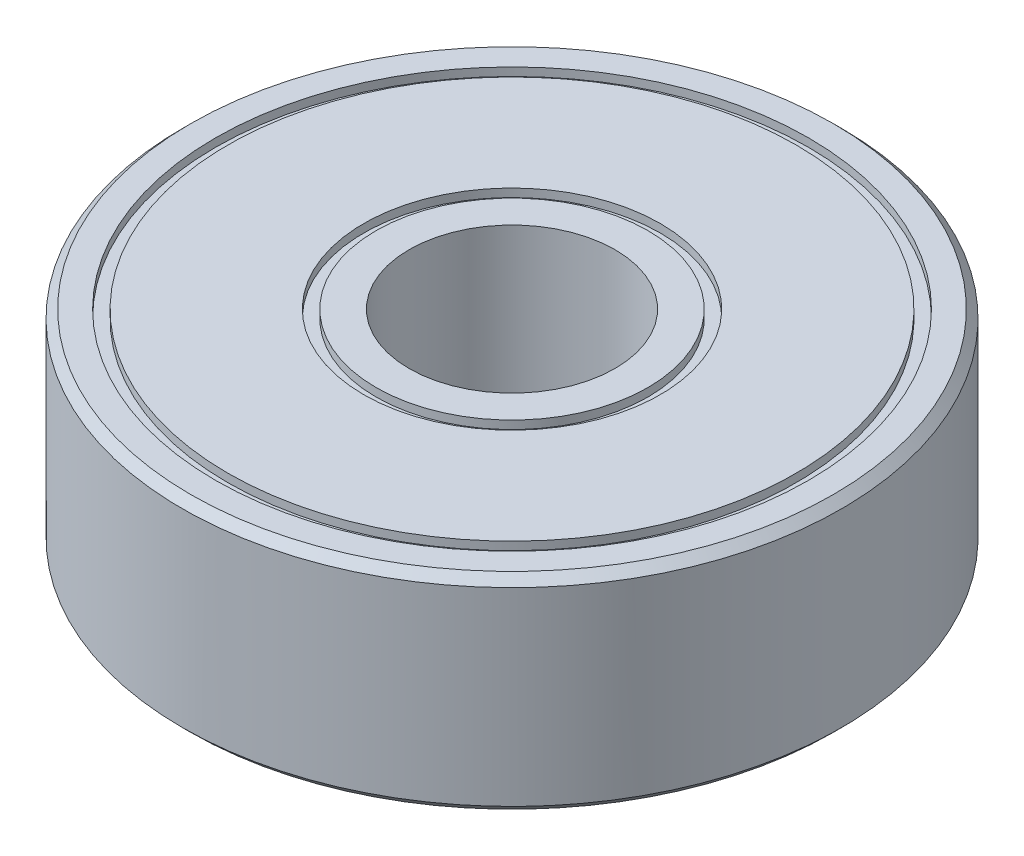
ISO-10303-21;
HEADER;
FILE_DESCRIPTION(('STEP AP214'),'2;1');
FILE_NAME('part.step','',(''),(''),'','','');
FILE_SCHEMA(('AUTOMOTIVE_DESIGN { 1 0 10303 214 1 1 1 1 }'));
ENDSEC;
DATA;
#1=APPLICATION_CONTEXT('core data for automotive mechanical design processes');
#2=APPLICATION_PROTOCOL_DEFINITION('international standard','automotive_design',2000,#1);
#3=PRODUCT_CONTEXT('',#1,'mechanical');
#4=PRODUCT('Part','Part','',(#3));
#5=PRODUCT_RELATED_PRODUCT_CATEGORY('part','',(#4));
#6=PRODUCT_DEFINITION_FORMATION('','',#4);
#7=PRODUCT_DEFINITION_CONTEXT('part definition',#1,'design');
#8=PRODUCT_DEFINITION('design','',#6,#7);
#9=PRODUCT_DEFINITION_SHAPE('','',#8);
#10=(LENGTH_UNIT() NAMED_UNIT(*) SI_UNIT(.MILLI.,.METRE.));
#11=(NAMED_UNIT(*) PLANE_ANGLE_UNIT() SI_UNIT($,.RADIAN.));
#12=(NAMED_UNIT(*) SI_UNIT($,.STERADIAN.) SOLID_ANGLE_UNIT());
#13=UNCERTAINTY_MEASURE_WITH_UNIT(LENGTH_MEASURE(1.E-05),#10,'distance_accuracy_value','');
#14=(GEOMETRIC_REPRESENTATION_CONTEXT(3) GLOBAL_UNCERTAINTY_ASSIGNED_CONTEXT((#13)) GLOBAL_UNIT_ASSIGNED_CONTEXT((#10,
#11,#12)) REPRESENTATION_CONTEXT('',''));
#15=CARTESIAN_POINT('',(0.,0.,0.));
#16=DIRECTION('',(0.,0.,1.));
#17=DIRECTION('',(1.,0.,0.));
#18=AXIS2_PLACEMENT_3D('',#15,#16,#17);
#19=CARTESIAN_POINT('',(0.,5.,0.));
#20=DIRECTION('',(0.,-1.,0.));
#21=DIRECTION('',(0.,0.,-1.));
#22=AXIS2_PLACEMENT_3D('',#19,#20,#21);
#23=CYLINDRICAL_SURFACE('',#22,2.5);
#24=CARTESIAN_POINT('',(0.,5.,0.));
#25=DIRECTION('',(0.,-1.,0.));
#26=DIRECTION('',(0.,0.,-1.));
#27=AXIS2_PLACEMENT_3D('',#24,#25,#26);
#28=CIRCLE('',#27,2.5);
#29=CARTESIAN_POINT('',(0.,5.,-2.5));
#30=VERTEX_POINT('',#29);
#31=EDGE_CURVE('E18',#30,#30,#28,.T.);
#32=ORIENTED_EDGE('',*,*,#31,.F.);
#33=EDGE_LOOP('',(#32));
#34=FACE_BOUND('',#33,.T.);
#35=CARTESIAN_POINT('',(0.,0.,0.));
#36=DIRECTION('',(0.,-1.,0.));
#37=DIRECTION('',(0.,0.,-1.));
#38=AXIS2_PLACEMENT_3D('',#35,#36,#37);
#39=CIRCLE('',#38,2.5);
#40=CARTESIAN_POINT('',(0.,0.,-2.5));
#41=VERTEX_POINT('',#40);
#42=EDGE_CURVE('E82',#41,#41,#39,.T.);
#43=ORIENTED_EDGE('',*,*,#42,.T.);
#44=EDGE_LOOP('',(#43));
#45=FACE_BOUND('',#44,.T.);
#46=ADVANCED_FACE('F15',(#34,#45),#23,.F.);
#47=CARTESIAN_POINT('',(0.,5.,0.));
#48=DIRECTION('',(0.,1.,0.));
#49=DIRECTION('',(0.,0.,1.));
#50=AXIS2_PLACEMENT_3D('',#47,#48,#49);
#51=PLANE('',#50);
#52=ORIENTED_EDGE('',*,*,#31,.T.);
#53=EDGE_LOOP('',(#52));
#54=FACE_BOUND('',#53,.T.);
#55=CARTESIAN_POINT('',(0.,5.,0.));
#56=DIRECTION('',(0.,1.,0.));
#57=DIRECTION('',(0.,0.,1.));
#58=AXIS2_PLACEMENT_3D('',#55,#56,#57);
#59=CIRCLE('',#58,3.3);
#60=CARTESIAN_POINT('',(0.,5.,3.3));
#61=VERTEX_POINT('',#60);
#62=EDGE_CURVE('E80',#61,#61,#59,.F.);
#63=ORIENTED_EDGE('',*,*,#62,.F.);
#64=EDGE_LOOP('',(#63));
#65=FACE_BOUND('',#64,.T.);
#66=ADVANCED_FACE('F89',(#54,#65),#51,.T.);
#67=CARTESIAN_POINT('',(0.,0.,0.));
#68=DIRECTION('',(0.,1.,0.));
#69=DIRECTION('',(0.,0.,1.));
#70=AXIS2_PLACEMENT_3D('',#67,#68,#69);
#71=PLANE('',#70);
#72=ORIENTED_EDGE('',*,*,#42,.F.);
#73=EDGE_LOOP('',(#72));
#74=FACE_BOUND('',#73,.T.);
#75=CARTESIAN_POINT('',(0.,0.,0.));
#76=DIRECTION('',(0.,1.,0.));
#77=DIRECTION('',(0.,0.,1.));
#78=AXIS2_PLACEMENT_3D('',#75,#76,#77);
#79=CIRCLE('',#78,3.3);
#80=CARTESIAN_POINT('',(0.,0.,3.3));
#81=VERTEX_POINT('',#80);
#82=EDGE_CURVE('E77',#81,#81,#79,.T.);
#83=ORIENTED_EDGE('',*,*,#82,.F.);
#84=EDGE_LOOP('',(#83));
#85=FACE_BOUND('',#84,.T.);
#86=ADVANCED_FACE('F97',(#74,#85),#71,.F.);
#87=CARTESIAN_POINT('',(0.,5.,0.));
#88=DIRECTION('',(0.,1.,0.));
#89=DIRECTION('',(0.,0.,1.));
#90=AXIS2_PLACEMENT_3D('',#87,#88,#89);
#91=CYLINDRICAL_SURFACE('',#90,3.3);
#92=ORIENTED_EDGE('',*,*,#62,.T.);
#93=EDGE_LOOP('',(#92));
#94=FACE_BOUND('',#93,.T.);
#95=CARTESIAN_POINT('',(0.,4.8,0.));
#96=DIRECTION('',(0.,1.,0.));
#97=DIRECTION('',(0.,0.,1.));
#98=AXIS2_PLACEMENT_3D('',#95,#96,#97);
#99=CIRCLE('',#98,3.3);
#100=CARTESIAN_POINT('',(0.,4.8,3.3));
#101=VERTEX_POINT('',#100);
#102=EDGE_CURVE('E74',#101,#101,#99,.F.);
#103=ORIENTED_EDGE('',*,*,#102,.F.);
#104=EDGE_LOOP('',(#103));
#105=FACE_BOUND('',#104,.T.);
#106=ADVANCED_FACE('F172',(#94,#105),#91,.T.);
#107=CARTESIAN_POINT('',(0.,5.,0.));
#108=DIRECTION('',(0.,1.,0.));
#109=DIRECTION('',(0.,0.,1.));
#110=AXIS2_PLACEMENT_3D('',#107,#108,#109);
#111=CYLINDRICAL_SURFACE('',#110,3.3);
#112=ORIENTED_EDGE('',*,*,#82,.T.);
#113=EDGE_LOOP('',(#112));
#114=FACE_BOUND('',#113,.T.);
#115=CARTESIAN_POINT('',(0.,0.2,0.));
#116=DIRECTION('',(0.,1.,0.));
#117=DIRECTION('',(0.,0.,1.));
#118=AXIS2_PLACEMENT_3D('',#115,#116,#117);
#119=CIRCLE('',#118,3.3);
#120=CARTESIAN_POINT('',(0.,0.2,3.3));
#121=VERTEX_POINT('',#120);
#122=EDGE_CURVE('E71',#121,#121,#119,.T.);
#123=ORIENTED_EDGE('',*,*,#122,.F.);
#124=EDGE_LOOP('',(#123));
#125=FACE_BOUND('',#124,.T.);
#126=ADVANCED_FACE('F168',(#114,#125),#111,.T.);
#127=CARTESIAN_POINT('',(0.,4.8,-3.3));
#128=DIRECTION('',(0.,1.,0.));
#129=DIRECTION('',(0.,0.,1.));
#130=AXIS2_PLACEMENT_3D('',#127,#128,#129);
#131=PLANE('',#130);
#132=CARTESIAN_POINT('',(0.,4.8,0.));
#133=DIRECTION('',(0.,1.,0.));
#134=DIRECTION('',(0.,0.,1.));
#135=AXIS2_PLACEMENT_3D('',#132,#133,#134);
#136=CIRCLE('',#135,3.6);
#137=CARTESIAN_POINT('',(0.,4.8,3.6));
#138=VERTEX_POINT('',#137);
#139=EDGE_CURVE('E68',#138,#138,#136,.T.);
#140=ORIENTED_EDGE('',*,*,#139,.T.);
#141=EDGE_LOOP('',(#140));
#142=FACE_BOUND('',#141,.T.);
#143=ORIENTED_EDGE('',*,*,#102,.T.);
#144=EDGE_LOOP('',(#143));
#145=FACE_BOUND('',#144,.T.);
#146=ADVANCED_FACE('F164',(#142,#145),#131,.T.);
#147=CARTESIAN_POINT('',(0.,0.2,-3.3));
#148=DIRECTION('',(0.,-1.,0.));
#149=DIRECTION('',(0.,0.,-1.));
#150=AXIS2_PLACEMENT_3D('',#147,#148,#149);
#151=PLANE('',#150);
#152=ORIENTED_EDGE('',*,*,#122,.T.);
#153=EDGE_LOOP('',(#152));
#154=FACE_BOUND('',#153,.T.);
#155=CARTESIAN_POINT('',(0.,0.2,0.));
#156=DIRECTION('',(0.,1.,0.));
#157=DIRECTION('',(0.,0.,1.));
#158=AXIS2_PLACEMENT_3D('',#155,#156,#157);
#159=CIRCLE('',#158,3.6);
#160=CARTESIAN_POINT('',(0.,0.2,3.6));
#161=VERTEX_POINT('',#160);
#162=EDGE_CURVE('E65',#161,#161,#159,.F.);
#163=ORIENTED_EDGE('',*,*,#162,.T.);
#164=EDGE_LOOP('',(#163));
#165=FACE_BOUND('',#164,.T.);
#166=ADVANCED_FACE('F160',(#154,#165),#151,.T.);
#167=CARTESIAN_POINT('',(0.,5.,0.));
#168=DIRECTION('',(0.,1.,0.));
#169=DIRECTION('',(0.,0.,1.));
#170=AXIS2_PLACEMENT_3D('',#167,#168,#169);
#171=CYLINDRICAL_SURFACE('',#170,3.6);
#172=ORIENTED_EDGE('',*,*,#139,.F.);
#173=EDGE_LOOP('',(#172));
#174=FACE_BOUND('',#173,.T.);
#175=CARTESIAN_POINT('',(0.,5.,0.));
#176=DIRECTION('',(0.,1.,0.));
#177=DIRECTION('',(0.,0.,1.));
#178=AXIS2_PLACEMENT_3D('',#175,#176,#177);
#179=CIRCLE('',#178,3.6);
#180=CARTESIAN_POINT('',(0.,5.,3.6));
#181=VERTEX_POINT('',#180);
#182=EDGE_CURVE('E62',#181,#181,#179,.F.);
#183=ORIENTED_EDGE('',*,*,#182,.F.);
#184=EDGE_LOOP('',(#183));
#185=FACE_BOUND('',#184,.T.);
#186=ADVANCED_FACE('F156',(#174,#185),#171,.F.);
#187=CARTESIAN_POINT('',(0.,5.,0.));
#188=DIRECTION('',(0.,1.,0.));
#189=DIRECTION('',(0.,0.,1.));
#190=AXIS2_PLACEMENT_3D('',#187,#188,#189);
#191=CYLINDRICAL_SURFACE('',#190,3.6);
#192=ORIENTED_EDGE('',*,*,#162,.F.);
#193=EDGE_LOOP('',(#192));
#194=FACE_BOUND('',#193,.T.);
#195=CARTESIAN_POINT('',(0.,0.,0.));
#196=DIRECTION('',(0.,1.,0.));
#197=DIRECTION('',(0.,0.,1.));
#198=AXIS2_PLACEMENT_3D('',#195,#196,#197);
#199=CIRCLE('',#198,3.6);
#200=CARTESIAN_POINT('',(0.,0.,3.6));
#201=VERTEX_POINT('',#200);
#202=EDGE_CURVE('E59',#201,#201,#199,.F.);
#203=ORIENTED_EDGE('',*,*,#202,.T.);
#204=EDGE_LOOP('',(#203));
#205=FACE_BOUND('',#204,.T.);
#206=ADVANCED_FACE('F152',(#194,#205),#191,.F.);
#207=CARTESIAN_POINT('',(0.,5.,0.));
#208=DIRECTION('',(0.,1.,0.));
#209=DIRECTION('',(0.,0.,1.));
#210=AXIS2_PLACEMENT_3D('',#207,#208,#209);
#211=PLANE('',#210);
#212=CARTESIAN_POINT('',(0.,5.,0.));
#213=DIRECTION('',(0.,1.,0.));
#214=DIRECTION('',(0.,0.,1.));
#215=AXIS2_PLACEMENT_3D('',#212,#213,#214);
#216=CIRCLE('',#215,6.9);
#217=CARTESIAN_POINT('',(0.,5.,6.9));
#218=VERTEX_POINT('',#217);
#219=EDGE_CURVE('E56',#218,#218,#216,.F.);
#220=ORIENTED_EDGE('',*,*,#219,.F.);
#221=EDGE_LOOP('',(#220));
#222=FACE_BOUND('',#221,.T.);
#223=ORIENTED_EDGE('',*,*,#182,.T.);
#224=EDGE_LOOP('',(#223));
#225=FACE_BOUND('',#224,.T.);
#226=ADVANCED_FACE('F148',(#222,#225),#211,.T.);
#227=CARTESIAN_POINT('',(0.,0.,0.));
#228=DIRECTION('',(0.,1.,0.));
#229=DIRECTION('',(0.,0.,1.));
#230=AXIS2_PLACEMENT_3D('',#227,#228,#229);
#231=PLANE('',#230);
#232=ORIENTED_EDGE('',*,*,#202,.F.);
#233=EDGE_LOOP('',(#232));
#234=FACE_BOUND('',#233,.T.);
#235=CARTESIAN_POINT('',(0.,0.,0.));
#236=DIRECTION('',(0.,1.,0.));
#237=DIRECTION('',(0.,0.,1.));
#238=AXIS2_PLACEMENT_3D('',#235,#236,#237);
#239=CIRCLE('',#238,6.9);
#240=CARTESIAN_POINT('',(0.,0.,6.9));
#241=VERTEX_POINT('',#240);
#242=EDGE_CURVE('E53',#241,#241,#239,.T.);
#243=ORIENTED_EDGE('',*,*,#242,.F.);
#244=EDGE_LOOP('',(#243));
#245=FACE_BOUND('',#244,.T.);
#246=ADVANCED_FACE('F144',(#234,#245),#231,.F.);
#247=CARTESIAN_POINT('',(0.,5.,0.));
#248=DIRECTION('',(0.,1.,0.));
#249=DIRECTION('',(0.,0.,1.));
#250=AXIS2_PLACEMENT_3D('',#247,#248,#249);
#251=CYLINDRICAL_SURFACE('',#250,6.9);
#252=ORIENTED_EDGE('',*,*,#219,.T.);
#253=EDGE_LOOP('',(#252));
#254=FACE_BOUND('',#253,.T.);
#255=CARTESIAN_POINT('',(0.,4.8,0.));
#256=DIRECTION('',(0.,1.,0.));
#257=DIRECTION('',(0.,0.,1.));
#258=AXIS2_PLACEMENT_3D('',#255,#256,#257);
#259=CIRCLE('',#258,6.9);
#260=CARTESIAN_POINT('',(0.,4.8,6.9));
#261=VERTEX_POINT('',#260);
#262=EDGE_CURVE('E50',#261,#261,#259,.F.);
#263=ORIENTED_EDGE('',*,*,#262,.F.);
#264=EDGE_LOOP('',(#263));
#265=FACE_BOUND('',#264,.T.);
#266=ADVANCED_FACE('F140',(#254,#265),#251,.T.);
#267=CARTESIAN_POINT('',(0.,5.,0.));
#268=DIRECTION('',(0.,1.,0.));
#269=DIRECTION('',(0.,0.,1.));
#270=AXIS2_PLACEMENT_3D('',#267,#268,#269);
#271=CYLINDRICAL_SURFACE('',#270,6.9);
#272=ORIENTED_EDGE('',*,*,#242,.T.);
#273=EDGE_LOOP('',(#272));
#274=FACE_BOUND('',#273,.T.);
#275=CARTESIAN_POINT('',(0.,0.2,0.));
#276=DIRECTION('',(0.,1.,0.));
#277=DIRECTION('',(0.,0.,1.));
#278=AXIS2_PLACEMENT_3D('',#275,#276,#277);
#279=CIRCLE('',#278,6.9);
#280=CARTESIAN_POINT('',(0.,0.2,6.9));
#281=VERTEX_POINT('',#280);
#282=EDGE_CURVE('E47',#281,#281,#279,.T.);
#283=ORIENTED_EDGE('',*,*,#282,.F.);
#284=EDGE_LOOP('',(#283));
#285=FACE_BOUND('',#284,.T.);
#286=ADVANCED_FACE('F136',(#274,#285),#271,.T.);
#287=CARTESIAN_POINT('',(0.,4.8,-7.2));
#288=DIRECTION('',(0.,1.,0.));
#289=DIRECTION('',(0.,0.,1.));
#290=AXIS2_PLACEMENT_3D('',#287,#288,#289);
#291=PLANE('',#290);
#292=CARTESIAN_POINT('',(0.,4.8,0.));
#293=DIRECTION('',(0.,1.,0.));
#294=DIRECTION('',(0.,0.,1.));
#295=AXIS2_PLACEMENT_3D('',#292,#293,#294);
#296=CIRCLE('',#295,7.2);
#297=CARTESIAN_POINT('',(0.,4.8,7.2));
#298=VERTEX_POINT('',#297);
#299=EDGE_CURVE('E44',#298,#298,#296,.T.);
#300=ORIENTED_EDGE('',*,*,#299,.T.);
#301=EDGE_LOOP('',(#300));
#302=FACE_BOUND('',#301,.T.);
#303=ORIENTED_EDGE('',*,*,#262,.T.);
#304=EDGE_LOOP('',(#303));
#305=FACE_BOUND('',#304,.T.);
#306=ADVANCED_FACE('F132',(#302,#305),#291,.T.);
#307=CARTESIAN_POINT('',(0.,0.2,-7.2));
#308=DIRECTION('',(0.,-1.,0.));
#309=DIRECTION('',(0.,0.,-1.));
#310=AXIS2_PLACEMENT_3D('',#307,#308,#309);
#311=PLANE('',#310);
#312=ORIENTED_EDGE('',*,*,#282,.T.);
#313=EDGE_LOOP('',(#312));
#314=FACE_BOUND('',#313,.T.);
#315=CARTESIAN_POINT('',(0.,0.2,0.));
#316=DIRECTION('',(0.,1.,0.));
#317=DIRECTION('',(0.,0.,1.));
#318=AXIS2_PLACEMENT_3D('',#315,#316,#317);
#319=CIRCLE('',#318,7.2);
#320=CARTESIAN_POINT('',(0.,0.2,7.2));
#321=VERTEX_POINT('',#320);
#322=EDGE_CURVE('E41',#321,#321,#319,.F.);
#323=ORIENTED_EDGE('',*,*,#322,.T.);
#324=EDGE_LOOP('',(#323));
#325=FACE_BOUND('',#324,.T.);
#326=ADVANCED_FACE('F128',(#314,#325),#311,.T.);
#327=CARTESIAN_POINT('',(0.,5.,0.));
#328=DIRECTION('',(0.,1.,0.));
#329=DIRECTION('',(0.,0.,1.));
#330=AXIS2_PLACEMENT_3D('',#327,#328,#329);
#331=CYLINDRICAL_SURFACE('',#330,7.2);
#332=ORIENTED_EDGE('',*,*,#299,.F.);
#333=EDGE_LOOP('',(#332));
#334=FACE_BOUND('',#333,.T.);
#335=CARTESIAN_POINT('',(0.,5.,0.));
#336=DIRECTION('',(0.,1.,0.));
#337=DIRECTION('',(0.,0.,1.));
#338=AXIS2_PLACEMENT_3D('',#335,#336,#337);
#339=CIRCLE('',#338,7.2);
#340=CARTESIAN_POINT('',(0.,5.,7.2));
#341=VERTEX_POINT('',#340);
#342=EDGE_CURVE('E38',#341,#341,#339,.F.);
#343=ORIENTED_EDGE('',*,*,#342,.F.);
#344=EDGE_LOOP('',(#343));
#345=FACE_BOUND('',#344,.T.);
#346=ADVANCED_FACE('F124',(#334,#345),#331,.F.);
#347=CARTESIAN_POINT('',(0.,5.,0.));
#348=DIRECTION('',(0.,1.,0.));
#349=DIRECTION('',(0.,0.,1.));
#350=AXIS2_PLACEMENT_3D('',#347,#348,#349);
#351=CYLINDRICAL_SURFACE('',#350,7.2);
#352=ORIENTED_EDGE('',*,*,#322,.F.);
#353=EDGE_LOOP('',(#352));
#354=FACE_BOUND('',#353,.T.);
#355=CARTESIAN_POINT('',(0.,0.,0.));
#356=DIRECTION('',(0.,1.,0.));
#357=DIRECTION('',(0.,0.,1.));
#358=AXIS2_PLACEMENT_3D('',#355,#356,#357);
#359=CIRCLE('',#358,7.2);
#360=CARTESIAN_POINT('',(0.,0.,7.2));
#361=VERTEX_POINT('',#360);
#362=EDGE_CURVE('E35',#361,#361,#359,.F.);
#363=ORIENTED_EDGE('',*,*,#362,.T.);
#364=EDGE_LOOP('',(#363));
#365=FACE_BOUND('',#364,.T.);
#366=ADVANCED_FACE('F120',(#354,#365),#351,.F.);
#367=CARTESIAN_POINT('',(0.,5.,0.));
#368=DIRECTION('',(0.,1.,0.));
#369=DIRECTION('',(0.,0.,1.));
#370=AXIS2_PLACEMENT_3D('',#367,#368,#369);
#371=PLANE('',#370);
#372=CARTESIAN_POINT('',(0.,5.,0.));
#373=DIRECTION('',(0.,-1.,0.));
#374=DIRECTION('',(0.,0.,-1.));
#375=AXIS2_PLACEMENT_3D('',#372,#373,#374);
#376=CIRCLE('',#375,7.80000000000001);
#377=CARTESIAN_POINT('',(0.,5.,-7.80000000000001));
#378=VERTEX_POINT('',#377);
#379=EDGE_CURVE('E32',#378,#378,#376,.T.);
#380=ORIENTED_EDGE('',*,*,#379,.F.);
#381=EDGE_LOOP('',(#380));
#382=FACE_BOUND('',#381,.T.);
#383=ORIENTED_EDGE('',*,*,#342,.T.);
#384=EDGE_LOOP('',(#383));
#385=FACE_BOUND('',#384,.T.);
#386=ADVANCED_FACE('F116',(#382,#385),#371,.T.);
#387=CARTESIAN_POINT('',(0.,0.,0.));
#388=DIRECTION('',(0.,1.,0.));
#389=DIRECTION('',(0.,0.,1.));
#390=AXIS2_PLACEMENT_3D('',#387,#388,#389);
#391=PLANE('',#390);
#392=CARTESIAN_POINT('',(0.,0.,0.));
#393=DIRECTION('',(0.,1.,0.));
#394=DIRECTION('',(0.,0.,1.));
#395=AXIS2_PLACEMENT_3D('',#392,#393,#394);
#396=CIRCLE('',#395,7.8);
#397=CARTESIAN_POINT('',(0.,0.,7.8));
#398=VERTEX_POINT('',#397);
#399=EDGE_CURVE('E27',#398,#398,#396,.T.);
#400=ORIENTED_EDGE('',*,*,#399,.F.);
#401=EDGE_LOOP('',(#400));
#402=FACE_BOUND('',#401,.T.);
#403=ORIENTED_EDGE('',*,*,#362,.F.);
#404=EDGE_LOOP('',(#403));
#405=FACE_BOUND('',#404,.T.);
#406=ADVANCED_FACE('F112',(#402,#405),#391,.F.);
#407=CARTESIAN_POINT('',(0.,4.80000000000001,0.));
#408=DIRECTION('',(0.,-1.,0.));
#409=DIRECTION('',(0.,0.,-1.));
#410=AXIS2_PLACEMENT_3D('',#407,#408,#409);
#411=CONICAL_SURFACE('',#410,8.,0.785398163397446);
#412=CARTESIAN_POINT('',(0.,4.80000000000001,0.));
#413=DIRECTION('',(0.,-1.,0.));
#414=DIRECTION('',(0.,0.,-1.));
#415=AXIS2_PLACEMENT_3D('',#412,#413,#414);
#416=CIRCLE('',#415,8.);
#417=CARTESIAN_POINT('',(0.,4.80000000000001,-8.));
#418=VERTEX_POINT('',#417);
#419=EDGE_CURVE('E22',#418,#418,#416,.T.);
#420=ORIENTED_EDGE('',*,*,#419,.F.);
#421=EDGE_LOOP('',(#420));
#422=FACE_BOUND('',#421,.T.);
#423=ORIENTED_EDGE('',*,*,#379,.T.);
#424=EDGE_LOOP('',(#423));
#425=FACE_BOUND('',#424,.T.);
#426=ADVANCED_FACE('F105',(#422,#425),#411,.T.);
#427=CARTESIAN_POINT('',(0.,0.199999999999999,0.));
#428=DIRECTION('',(0.,1.,0.));
#429=DIRECTION('',(0.,0.,1.));
#430=AXIS2_PLACEMENT_3D('',#427,#428,#429);
#431=CONICAL_SURFACE('',#430,8.,0.785398163397443);
#432=CARTESIAN_POINT('',(0.,0.199999999999999,0.));
#433=DIRECTION('',(0.,-1.,0.));
#434=DIRECTION('',(0.,0.,-1.));
#435=AXIS2_PLACEMENT_3D('',#432,#433,#434);
#436=CIRCLE('',#435,8.);
#437=CARTESIAN_POINT('',(0.,0.199999999999999,-8.));
#438=VERTEX_POINT('',#437);
#439=EDGE_CURVE('E10',#438,#438,#436,.F.);
#440=ORIENTED_EDGE('',*,*,#439,.F.);
#441=EDGE_LOOP('',(#440));
#442=FACE_BOUND('',#441,.T.);
#443=ORIENTED_EDGE('',*,*,#399,.T.);
#444=EDGE_LOOP('',(#443));
#445=FACE_BOUND('',#444,.T.);
#446=ADVANCED_FACE('F100',(#442,#445),#431,.T.);
#447=CARTESIAN_POINT('',(0.,5.,0.));
#448=DIRECTION('',(0.,-1.,0.));
#449=DIRECTION('',(0.,0.,-1.));
#450=AXIS2_PLACEMENT_3D('',#447,#448,#449);
#451=CYLINDRICAL_SURFACE('',#450,8.);
#452=ORIENTED_EDGE('',*,*,#439,.T.);
#453=EDGE_LOOP('',(#452));
#454=FACE_BOUND('',#453,.T.);
#455=ORIENTED_EDGE('',*,*,#419,.T.);
#456=EDGE_LOOP('',(#455));
#457=FACE_BOUND('',#456,.T.);
#458=ADVANCED_FACE('F98',(#454,#457),#451,.T.);
#459=CLOSED_SHELL('',(#46,#66,#86,#106,#126,#146,#166,#186,#206,#226,#246,#266,#286,#306,#326,
#346,#366,#386,#406,#426,#446,#458));
#460=MANIFOLD_SOLID_BREP('B1',#459);
#461=ADVANCED_BREP_SHAPE_REPRESENTATION('',(#18,#460),#14);
#462=SHAPE_DEFINITION_REPRESENTATION(#9,#461);
ENDSEC;
END-ISO-10303-21;
